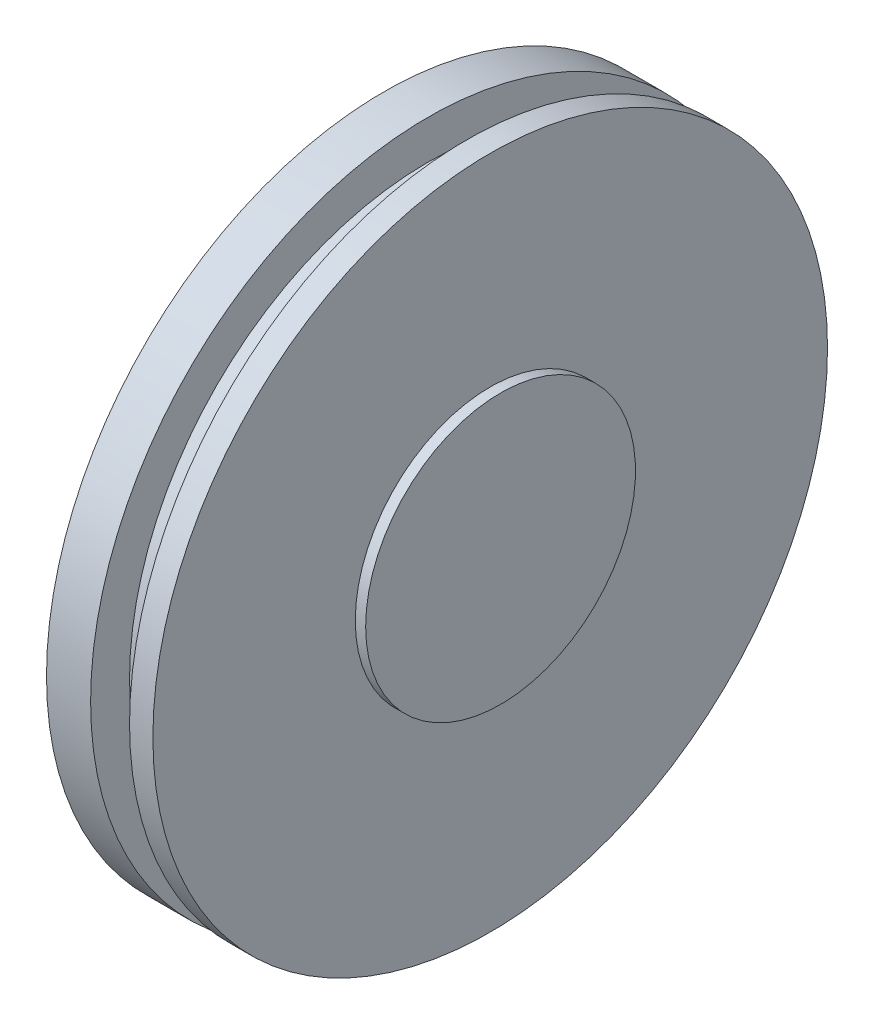
ISO-10303-21;
HEADER;
FILE_DESCRIPTION(('STEP AP214'),'2;1');
FILE_NAME('part.step','',(''),(''),'','','');
FILE_SCHEMA(('AUTOMOTIVE_DESIGN { 1 0 10303 214 1 1 1 1 }'));
ENDSEC;
DATA;
#1=APPLICATION_CONTEXT('core data for automotive mechanical design processes');
#2=APPLICATION_PROTOCOL_DEFINITION('international standard','automotive_design',2000,#1);
#3=PRODUCT_CONTEXT('',#1,'mechanical');
#4=PRODUCT('Part','Part','',(#3));
#5=PRODUCT_RELATED_PRODUCT_CATEGORY('part','',(#4));
#6=PRODUCT_DEFINITION_FORMATION('','',#4);
#7=PRODUCT_DEFINITION_CONTEXT('part definition',#1,'design');
#8=PRODUCT_DEFINITION('design','',#6,#7);
#9=PRODUCT_DEFINITION_SHAPE('','',#8);
#10=(LENGTH_UNIT() NAMED_UNIT(*) SI_UNIT(.MILLI.,.METRE.));
#11=(NAMED_UNIT(*) PLANE_ANGLE_UNIT() SI_UNIT($,.RADIAN.));
#12=(NAMED_UNIT(*) SI_UNIT($,.STERADIAN.) SOLID_ANGLE_UNIT());
#13=UNCERTAINTY_MEASURE_WITH_UNIT(LENGTH_MEASURE(1.E-05),#10,'distance_accuracy_value','');
#14=(GEOMETRIC_REPRESENTATION_CONTEXT(3) GLOBAL_UNCERTAINTY_ASSIGNED_CONTEXT((#13)) GLOBAL_UNIT_ASSIGNED_CONTEXT((#10,
#11,#12)) REPRESENTATION_CONTEXT('',''));
#15=CARTESIAN_POINT('',(0.,0.,0.));
#16=DIRECTION('',(0.,0.,1.));
#17=DIRECTION('',(1.,0.,0.));
#18=AXIS2_PLACEMENT_3D('',#15,#16,#17);
#19=CARTESIAN_POINT('',(-3.74521028037383,0.,0.));
#20=DIRECTION('',(-1.,0.,0.));
#21=DIRECTION('',(0.,0.,1.));
#22=AXIS2_PLACEMENT_3D('',#19,#20,#21);
#23=CYLINDRICAL_SURFACE('',#22,13.);
#24=CARTESIAN_POINT('',(-4.50000000000001,0.,0.));
#25=DIRECTION('',(-1.,0.,0.));
#26=DIRECTION('',(0.,0.,1.));
#27=AXIS2_PLACEMENT_3D('',#24,#25,#26);
#28=CIRCLE('',#27,13.);
#29=CARTESIAN_POINT('',(-4.50000000000001,0.,13.));
#30=VERTEX_POINT('',#29);
#31=EDGE_CURVE('E10',#30,#30,#28,.T.);
#32=ORIENTED_EDGE('',*,*,#31,.F.);
#33=EDGE_LOOP('',(#32));
#34=FACE_BOUND('',#33,.T.);
#35=CARTESIAN_POINT('',(-2.8,0.,0.));
#36=DIRECTION('',(-1.,0.,0.));
#37=DIRECTION('',(0.,0.,1.));
#38=AXIS2_PLACEMENT_3D('',#35,#36,#37);
#39=CIRCLE('',#38,13.);
#40=CARTESIAN_POINT('',(-2.8,0.,13.));
#41=VERTEX_POINT('',#40);
#42=EDGE_CURVE('E56',#41,#41,#39,.T.);
#43=ORIENTED_EDGE('',*,*,#42,.T.);
#44=EDGE_LOOP('',(#43));
#45=FACE_BOUND('',#44,.T.);
#46=ADVANCED_FACE('F28',(#34,#45),#23,.T.);
#47=CARTESIAN_POINT('',(-4.50000000000001,13.,0.));
#48=DIRECTION('',(1.,0.,0.));
#49=DIRECTION('',(0.,0.,-1.));
#50=AXIS2_PLACEMENT_3D('',#47,#48,#49);
#51=PLANE('',#50);
#52=ORIENTED_EDGE('',*,*,#31,.T.);
#53=EDGE_LOOP('',(#52));
#54=FACE_BOUND('',#53,.T.);
#55=ADVANCED_FACE('F73',(#54),#51,.F.);
#56=CARTESIAN_POINT('',(0.,5.2,0.));
#57=DIRECTION('',(1.,0.,0.));
#58=DIRECTION('',(0.,0.,-1.));
#59=AXIS2_PLACEMENT_3D('',#56,#57,#58);
#60=PLANE('',#59);
#61=CARTESIAN_POINT('',(0.,0.,0.));
#62=DIRECTION('',(-1.,0.,0.));
#63=DIRECTION('',(0.,0.,1.));
#64=AXIS2_PLACEMENT_3D('',#61,#62,#63);
#65=CIRCLE('',#64,5.2);
#66=CARTESIAN_POINT('',(0.,0.,5.2));
#67=VERTEX_POINT('',#66);
#68=EDGE_CURVE('E34',#67,#67,#65,.T.);
#69=ORIENTED_EDGE('',*,*,#68,.F.);
#70=EDGE_LOOP('',(#69));
#71=FACE_BOUND('',#70,.T.);
#72=ADVANCED_FACE('F78',(#71),#60,.T.);
#73=CARTESIAN_POINT('',(-3.74521028037383,0.,0.));
#74=DIRECTION('',(-1.,0.,0.));
#75=DIRECTION('',(0.,0.,1.));
#76=AXIS2_PLACEMENT_3D('',#73,#74,#75);
#77=CYLINDRICAL_SURFACE('',#76,5.2);
#78=ORIENTED_EDGE('',*,*,#68,.T.);
#79=EDGE_LOOP('',(#78));
#80=FACE_BOUND('',#79,.T.);
#81=CARTESIAN_POINT('',(-0.400000000000012,0.,0.));
#82=DIRECTION('',(-1.,0.,0.));
#83=DIRECTION('',(0.,0.,1.));
#84=AXIS2_PLACEMENT_3D('',#81,#82,#83);
#85=CIRCLE('',#84,5.2);
#86=CARTESIAN_POINT('',(-0.400000000000012,0.,5.2));
#87=VERTEX_POINT('',#86);
#88=EDGE_CURVE('E38',#87,#87,#85,.T.);
#89=ORIENTED_EDGE('',*,*,#88,.F.);
#90=EDGE_LOOP('',(#89));
#91=FACE_BOUND('',#90,.T.);
#92=ADVANCED_FACE('F82',(#80,#91),#77,.T.);
#93=CARTESIAN_POINT('',(-0.400000000000013,13.,0.));
#94=DIRECTION('',(1.,0.,0.));
#95=DIRECTION('',(0.,0.,-1.));
#96=AXIS2_PLACEMENT_3D('',#93,#94,#95);
#97=PLANE('',#96);
#98=ORIENTED_EDGE('',*,*,#88,.T.);
#99=EDGE_LOOP('',(#98));
#100=FACE_BOUND('',#99,.T.);
#101=CARTESIAN_POINT('',(-0.400000000000013,0.,0.));
#102=DIRECTION('',(-1.,0.,0.));
#103=DIRECTION('',(0.,0.,1.));
#104=AXIS2_PLACEMENT_3D('',#101,#102,#103);
#105=CIRCLE('',#104,13.);
#106=CARTESIAN_POINT('',(-0.400000000000013,0.,13.));
#107=VERTEX_POINT('',#106);
#108=EDGE_CURVE('E42',#107,#107,#105,.T.);
#109=ORIENTED_EDGE('',*,*,#108,.F.);
#110=EDGE_LOOP('',(#109));
#111=FACE_BOUND('',#110,.T.);
#112=ADVANCED_FACE('F88',(#100,#111),#97,.T.);
#113=CARTESIAN_POINT('',(-3.74521028037383,0.,0.));
#114=DIRECTION('',(-1.,0.,0.));
#115=DIRECTION('',(0.,0.,1.));
#116=AXIS2_PLACEMENT_3D('',#113,#114,#115);
#117=CYLINDRICAL_SURFACE('',#116,13.);
#118=CARTESIAN_POINT('',(-1.3,0.,0.));
#119=DIRECTION('',(-1.,0.,0.));
#120=DIRECTION('',(0.,0.,1.));
#121=AXIS2_PLACEMENT_3D('',#118,#119,#120);
#122=CIRCLE('',#121,13.);
#123=CARTESIAN_POINT('',(-1.3,0.,13.));
#124=VERTEX_POINT('',#123);
#125=EDGE_CURVE('E47',#124,#124,#122,.T.);
#126=ORIENTED_EDGE('',*,*,#125,.F.);
#127=EDGE_LOOP('',(#126));
#128=FACE_BOUND('',#127,.T.);
#129=ORIENTED_EDGE('',*,*,#108,.T.);
#130=EDGE_LOOP('',(#129));
#131=FACE_BOUND('',#130,.T.);
#132=ADVANCED_FACE('F91',(#128,#131),#117,.T.);
#133=CARTESIAN_POINT('',(-1.3,13.,0.));
#134=DIRECTION('',(1.,0.,0.));
#135=DIRECTION('',(0.,0.,-1.));
#136=AXIS2_PLACEMENT_3D('',#133,#134,#135);
#137=PLANE('',#136);
#138=CARTESIAN_POINT('',(-1.3,0.,0.));
#139=DIRECTION('',(-1.,0.,0.));
#140=DIRECTION('',(0.,0.,1.));
#141=AXIS2_PLACEMENT_3D('',#138,#139,#140);
#142=CIRCLE('',#141,11.5);
#143=CARTESIAN_POINT('',(-1.3,0.,11.5));
#144=VERTEX_POINT('',#143);
#145=EDGE_CURVE('E50',#144,#144,#142,.T.);
#146=ORIENTED_EDGE('',*,*,#145,.F.);
#147=EDGE_LOOP('',(#146));
#148=FACE_BOUND('',#147,.T.);
#149=ORIENTED_EDGE('',*,*,#125,.T.);
#150=EDGE_LOOP('',(#149));
#151=FACE_BOUND('',#150,.T.);
#152=ADVANCED_FACE('F69',(#148,#151),#137,.F.);
#153=CARTESIAN_POINT('',(-3.74521028037383,0.,0.));
#154=DIRECTION('',(-1.,0.,0.));
#155=DIRECTION('',(0.,0.,1.));
#156=AXIS2_PLACEMENT_3D('',#153,#154,#155);
#157=CYLINDRICAL_SURFACE('',#156,11.5);
#158=ORIENTED_EDGE('',*,*,#145,.T.);
#159=EDGE_LOOP('',(#158));
#160=FACE_BOUND('',#159,.T.);
#161=CARTESIAN_POINT('',(-2.8,0.,0.));
#162=DIRECTION('',(-1.,0.,0.));
#163=DIRECTION('',(0.,0.,1.));
#164=AXIS2_PLACEMENT_3D('',#161,#162,#163);
#165=CIRCLE('',#164,11.5);
#166=CARTESIAN_POINT('',(-2.8,0.,11.5));
#167=VERTEX_POINT('',#166);
#168=EDGE_CURVE('E53',#167,#167,#165,.T.);
#169=ORIENTED_EDGE('',*,*,#168,.F.);
#170=EDGE_LOOP('',(#169));
#171=FACE_BOUND('',#170,.T.);
#172=ADVANCED_FACE('F63',(#160,#171),#157,.T.);
#173=CARTESIAN_POINT('',(-2.8,13.,0.));
#174=DIRECTION('',(1.,0.,0.));
#175=DIRECTION('',(0.,0.,-1.));
#176=AXIS2_PLACEMENT_3D('',#173,#174,#175);
#177=PLANE('',#176);
#178=ORIENTED_EDGE('',*,*,#168,.T.);
#179=EDGE_LOOP('',(#178));
#180=FACE_BOUND('',#179,.T.);
#181=ORIENTED_EDGE('',*,*,#42,.F.);
#182=EDGE_LOOP('',(#181));
#183=FACE_BOUND('',#182,.T.);
#184=ADVANCED_FACE('F61',(#180,#183),#177,.T.);
#185=CLOSED_SHELL('',(#46,#55,#72,#92,#112,#132,#152,#172,#184));
#186=MANIFOLD_SOLID_BREP('B2',#185);
#187=ADVANCED_BREP_SHAPE_REPRESENTATION('',(#18,#186),#14);
#188=SHAPE_DEFINITION_REPRESENTATION(#9,#187);
ENDSEC;
END-ISO-10303-21;
